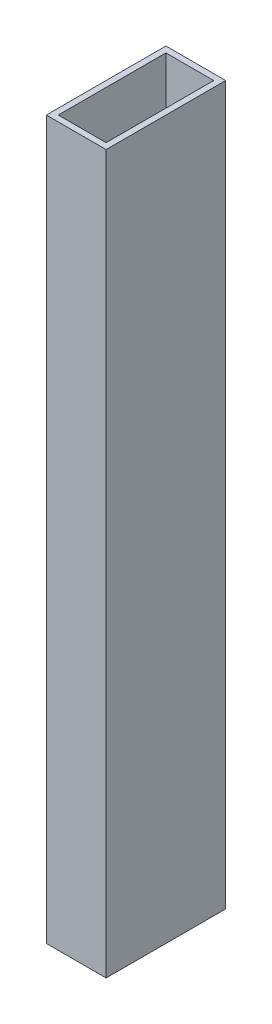
ISO-10303-21;
HEADER;
FILE_DESCRIPTION(('STEP AP214'),'2;1');
FILE_NAME('part.step','',(''),(''),'','','');
FILE_SCHEMA(('AUTOMOTIVE_DESIGN { 1 0 10303 214 1 1 1 1 }'));
ENDSEC;
DATA;
#1=APPLICATION_CONTEXT('core data for automotive mechanical design processes');
#2=APPLICATION_PROTOCOL_DEFINITION('international standard','automotive_design',2000,#1);
#3=PRODUCT_CONTEXT('',#1,'mechanical');
#4=PRODUCT('Part','Part','',(#3));
#5=PRODUCT_RELATED_PRODUCT_CATEGORY('part','',(#4));
#6=PRODUCT_DEFINITION_FORMATION('','',#4);
#7=PRODUCT_DEFINITION_CONTEXT('part definition',#1,'design');
#8=PRODUCT_DEFINITION('design','',#6,#7);
#9=PRODUCT_DEFINITION_SHAPE('','',#8);
#10=(LENGTH_UNIT() NAMED_UNIT(*) SI_UNIT(.MILLI.,.METRE.));
#11=(NAMED_UNIT(*) PLANE_ANGLE_UNIT() SI_UNIT($,.RADIAN.));
#12=(NAMED_UNIT(*) SI_UNIT($,.STERADIAN.) SOLID_ANGLE_UNIT());
#13=UNCERTAINTY_MEASURE_WITH_UNIT(LENGTH_MEASURE(1.E-05),#10,'distance_accuracy_value','');
#14=(GEOMETRIC_REPRESENTATION_CONTEXT(3) GLOBAL_UNCERTAINTY_ASSIGNED_CONTEXT((#13)) GLOBAL_UNIT_ASSIGNED_CONTEXT((#10,
#11,#12)) REPRESENTATION_CONTEXT('',''));
#15=CARTESIAN_POINT('',(0.,0.,0.));
#16=DIRECTION('',(0.,0.,1.));
#17=DIRECTION('',(1.,0.,0.));
#18=AXIS2_PLACEMENT_3D('',#15,#16,#17);
#19=CARTESIAN_POINT('',(0.,120.,0.));
#20=DIRECTION('',(0.,1.,0.));
#21=DIRECTION('',(0.,0.,1.));
#22=AXIS2_PLACEMENT_3D('',#19,#20,#21);
#23=PLANE('',#22);
#24=DIRECTION('',(0.,0.,1.));
#25=VECTOR('',#24,1.);
#26=CARTESIAN_POINT('',(-5.,120.,10.));
#27=LINE('',#26,#25);
#28=CARTESIAN_POINT('',(-5.,120.,-9.99999999999999));
#29=VERTEX_POINT('',#28);
#30=CARTESIAN_POINT('',(-5.,120.,10.));
#31=VERTEX_POINT('',#30);
#32=EDGE_CURVE('E136',#29,#31,#27,.T.);
#33=ORIENTED_EDGE('',*,*,#32,.T.);
#34=DIRECTION('',(1.,0.,0.));
#35=VECTOR('',#34,1.);
#36=CARTESIAN_POINT('',(5.,120.,10.));
#37=LINE('',#36,#35);
#38=CARTESIAN_POINT('',(5.,120.,10.));
#39=VERTEX_POINT('',#38);
#40=EDGE_CURVE('E139',#31,#39,#37,.T.);
#41=ORIENTED_EDGE('',*,*,#40,.T.);
#42=DIRECTION('',(0.,0.,-1.));
#43=VECTOR('',#42,1.);
#44=CARTESIAN_POINT('',(5.,120.,10.));
#45=LINE('',#44,#43);
#46=CARTESIAN_POINT('',(5.,120.,-10.));
#47=VERTEX_POINT('',#46);
#48=EDGE_CURVE('E142',#39,#47,#45,.T.);
#49=ORIENTED_EDGE('',*,*,#48,.T.);
#50=DIRECTION('',(-1.,0.,0.));
#51=VECTOR('',#50,1.);
#52=CARTESIAN_POINT('',(5.,120.,-10.));
#53=LINE('',#52,#51);
#54=EDGE_CURVE('E144',#47,#29,#53,.T.);
#55=ORIENTED_EDGE('',*,*,#54,.T.);
#56=EDGE_LOOP('',(#33,#41,#49,#55));
#57=FACE_BOUND('',#56,.T.);
#58=DIRECTION('',(1.,0.,0.));
#59=VECTOR('',#58,1.);
#60=CARTESIAN_POINT('',(4.,120.,9.));
#61=LINE('',#60,#59);
#62=CARTESIAN_POINT('',(-4.,120.,9.));
#63=VERTEX_POINT('',#62);
#64=CARTESIAN_POINT('',(4.,120.,9.));
#65=VERTEX_POINT('',#64);
#66=EDGE_CURVE('E108',#63,#65,#61,.T.);
#67=ORIENTED_EDGE('',*,*,#66,.F.);
#68=DIRECTION('',(0.,0.,1.));
#69=VECTOR('',#68,1.);
#70=CARTESIAN_POINT('',(-4.,120.,9.));
#71=LINE('',#70,#69);
#72=CARTESIAN_POINT('',(-4.,120.,-9.));
#73=VERTEX_POINT('',#72);
#74=EDGE_CURVE('E100',#73,#63,#71,.T.);
#75=ORIENTED_EDGE('',*,*,#74,.F.);
#76=DIRECTION('',(-1.,0.,0.));
#77=VECTOR('',#76,1.);
#78=CARTESIAN_POINT('',(4.,120.,-9.));
#79=LINE('',#78,#77);
#80=CARTESIAN_POINT('',(4.,120.,-9.));
#81=VERTEX_POINT('',#80);
#82=EDGE_CURVE('E122',#81,#73,#79,.T.);
#83=ORIENTED_EDGE('',*,*,#82,.F.);
#84=DIRECTION('',(0.,0.,-1.));
#85=VECTOR('',#84,1.);
#86=CARTESIAN_POINT('',(4.,120.,9.));
#87=LINE('',#86,#85);
#88=EDGE_CURVE('E120',#65,#81,#87,.T.);
#89=ORIENTED_EDGE('',*,*,#88,.F.);
#90=EDGE_LOOP('',(#67,#75,#83,#89));
#91=FACE_BOUND('',#90,.T.);
#92=ADVANCED_FACE('F35',(#57,#91),#23,.T.);
#93=CARTESIAN_POINT('',(0.,0.,0.));
#94=DIRECTION('',(0.,1.,0.));
#95=DIRECTION('',(0.,0.,1.));
#96=AXIS2_PLACEMENT_3D('',#93,#94,#95);
#97=PLANE('',#96);
#98=DIRECTION('',(0.,0.,1.));
#99=VECTOR('',#98,1.);
#100=CARTESIAN_POINT('',(-5.,0.,10.));
#101=LINE('',#100,#99);
#102=CARTESIAN_POINT('',(-5.,0.,-9.99999999999999));
#103=VERTEX_POINT('',#102);
#104=CARTESIAN_POINT('',(-5.,0.,10.));
#105=VERTEX_POINT('',#104);
#106=EDGE_CURVE('E116',#103,#105,#101,.T.);
#107=ORIENTED_EDGE('',*,*,#106,.F.);
#108=DIRECTION('',(-1.,0.,0.));
#109=VECTOR('',#108,1.);
#110=CARTESIAN_POINT('',(5.,0.,-10.));
#111=LINE('',#110,#109);
#112=CARTESIAN_POINT('',(5.,0.,-10.));
#113=VERTEX_POINT('',#112);
#114=EDGE_CURVE('E140',#113,#103,#111,.T.);
#115=ORIENTED_EDGE('',*,*,#114,.F.);
#116=DIRECTION('',(0.,0.,-1.));
#117=VECTOR('',#116,1.);
#118=CARTESIAN_POINT('',(5.,0.,10.));
#119=LINE('',#118,#117);
#120=CARTESIAN_POINT('',(5.,0.,10.));
#121=VERTEX_POINT('',#120);
#122=EDGE_CURVE('E151',#121,#113,#119,.T.);
#123=ORIENTED_EDGE('',*,*,#122,.F.);
#124=DIRECTION('',(1.,0.,0.));
#125=VECTOR('',#124,1.);
#126=CARTESIAN_POINT('',(5.,0.,10.));
#127=LINE('',#126,#125);
#128=EDGE_CURVE('E149',#105,#121,#127,.T.);
#129=ORIENTED_EDGE('',*,*,#128,.F.);
#130=EDGE_LOOP('',(#107,#115,#123,#129));
#131=FACE_BOUND('',#130,.T.);
#132=DIRECTION('',(0.,0.,1.));
#133=VECTOR('',#132,1.);
#134=CARTESIAN_POINT('',(-4.,0.,9.));
#135=LINE('',#134,#133);
#136=CARTESIAN_POINT('',(-4.,0.,-9.));
#137=VERTEX_POINT('',#136);
#138=CARTESIAN_POINT('',(-4.,0.,9.));
#139=VERTEX_POINT('',#138);
#140=EDGE_CURVE('E58',#137,#139,#135,.T.);
#141=ORIENTED_EDGE('',*,*,#140,.T.);
#142=DIRECTION('',(1.,0.,0.));
#143=VECTOR('',#142,1.);
#144=CARTESIAN_POINT('',(4.,0.,9.));
#145=LINE('',#144,#143);
#146=CARTESIAN_POINT('',(4.,0.,9.));
#147=VERTEX_POINT('',#146);
#148=EDGE_CURVE('E115',#139,#147,#145,.T.);
#149=ORIENTED_EDGE('',*,*,#148,.T.);
#150=DIRECTION('',(0.,0.,-1.));
#151=VECTOR('',#150,1.);
#152=CARTESIAN_POINT('',(4.,0.,9.));
#153=LINE('',#152,#151);
#154=CARTESIAN_POINT('',(4.,0.,-9.));
#155=VERTEX_POINT('',#154);
#156=EDGE_CURVE('E128',#147,#155,#153,.T.);
#157=ORIENTED_EDGE('',*,*,#156,.T.);
#158=DIRECTION('',(-1.,0.,0.));
#159=VECTOR('',#158,1.);
#160=CARTESIAN_POINT('',(4.,0.,-9.));
#161=LINE('',#160,#159);
#162=EDGE_CURVE('E109',#155,#137,#161,.T.);
#163=ORIENTED_EDGE('',*,*,#162,.T.);
#164=EDGE_LOOP('',(#141,#149,#157,#163));
#165=FACE_BOUND('',#164,.T.);
#166=ADVANCED_FACE('F169',(#131,#165),#97,.F.);
#167=CARTESIAN_POINT('',(-5.,120.,10.));
#168=DIRECTION('',(1.,0.,0.));
#169=DIRECTION('',(0.,0.,-1.));
#170=AXIS2_PLACEMENT_3D('',#167,#168,#169);
#171=PLANE('',#170);
#172=ORIENTED_EDGE('',*,*,#106,.T.);
#173=DIRECTION('',(0.,-1.,0.));
#174=VECTOR('',#173,1.);
#175=CARTESIAN_POINT('',(-5.,120.,10.));
#176=LINE('',#175,#174);
#177=EDGE_CURVE('E11',#31,#105,#176,.T.);
#178=ORIENTED_EDGE('',*,*,#177,.F.);
#179=ORIENTED_EDGE('',*,*,#32,.F.);
#180=DIRECTION('',(0.,-1.,0.));
#181=VECTOR('',#180,1.);
#182=CARTESIAN_POINT('',(-5.,120.,-9.99999999999999));
#183=LINE('',#182,#181);
#184=EDGE_CURVE('E146',#29,#103,#183,.T.);
#185=ORIENTED_EDGE('',*,*,#184,.T.);
#186=EDGE_LOOP('',(#172,#178,#179,#185));
#187=FACE_BOUND('',#186,.T.);
#188=ADVANCED_FACE('F37',(#187),#171,.F.);
#189=CARTESIAN_POINT('',(5.,120.,10.));
#190=DIRECTION('',(0.,0.,-1.));
#191=DIRECTION('',(-1.,0.,0.));
#192=AXIS2_PLACEMENT_3D('',#189,#190,#191);
#193=PLANE('',#192);
#194=ORIENTED_EDGE('',*,*,#128,.T.);
#195=DIRECTION('',(0.,-1.,0.));
#196=VECTOR('',#195,1.);
#197=CARTESIAN_POINT('',(5.,120.,10.));
#198=LINE('',#197,#196);
#199=EDGE_CURVE('E43',#39,#121,#198,.T.);
#200=ORIENTED_EDGE('',*,*,#199,.F.);
#201=ORIENTED_EDGE('',*,*,#40,.F.);
#202=ORIENTED_EDGE('',*,*,#177,.T.);
#203=EDGE_LOOP('',(#194,#200,#201,#202));
#204=FACE_BOUND('',#203,.T.);
#205=ADVANCED_FACE('F179',(#204),#193,.F.);
#206=CARTESIAN_POINT('',(5.,120.,10.));
#207=DIRECTION('',(-1.,0.,0.));
#208=DIRECTION('',(0.,0.,1.));
#209=AXIS2_PLACEMENT_3D('',#206,#207,#208);
#210=PLANE('',#209);
#211=ORIENTED_EDGE('',*,*,#122,.T.);
#212=DIRECTION('',(0.,-1.,0.));
#213=VECTOR('',#212,1.);
#214=CARTESIAN_POINT('',(5.,120.,-10.));
#215=LINE('',#214,#213);
#216=EDGE_CURVE('E156',#47,#113,#215,.T.);
#217=ORIENTED_EDGE('',*,*,#216,.F.);
#218=ORIENTED_EDGE('',*,*,#48,.F.);
#219=ORIENTED_EDGE('',*,*,#199,.T.);
#220=EDGE_LOOP('',(#211,#217,#218,#219));
#221=FACE_BOUND('',#220,.T.);
#222=ADVANCED_FACE('F163',(#221),#210,.F.);
#223=CARTESIAN_POINT('',(5.,120.,-10.));
#224=DIRECTION('',(0.,0.,1.));
#225=DIRECTION('',(1.,0.,0.));
#226=AXIS2_PLACEMENT_3D('',#223,#224,#225);
#227=PLANE('',#226);
#228=ORIENTED_EDGE('',*,*,#114,.T.);
#229=ORIENTED_EDGE('',*,*,#184,.F.);
#230=ORIENTED_EDGE('',*,*,#54,.F.);
#231=ORIENTED_EDGE('',*,*,#216,.T.);
#232=EDGE_LOOP('',(#228,#229,#230,#231));
#233=FACE_BOUND('',#232,.T.);
#234=ADVANCED_FACE('F173',(#233),#227,.F.);
#235=CARTESIAN_POINT('',(-4.,120.,9.));
#236=DIRECTION('',(1.,0.,0.));
#237=DIRECTION('',(0.,0.,-1.));
#238=AXIS2_PLACEMENT_3D('',#235,#236,#237);
#239=PLANE('',#238);
#240=ORIENTED_EDGE('',*,*,#140,.F.);
#241=DIRECTION('',(0.,-1.,0.));
#242=VECTOR('',#241,1.);
#243=CARTESIAN_POINT('',(-4.,120.,-9.));
#244=LINE('',#243,#242);
#245=EDGE_CURVE('E104',#73,#137,#244,.T.);
#246=ORIENTED_EDGE('',*,*,#245,.F.);
#247=ORIENTED_EDGE('',*,*,#74,.T.);
#248=DIRECTION('',(0.,-1.,0.));
#249=VECTOR('',#248,1.);
#250=CARTESIAN_POINT('',(-4.,120.,9.));
#251=LINE('',#250,#249);
#252=EDGE_CURVE('E103',#63,#139,#251,.T.);
#253=ORIENTED_EDGE('',*,*,#252,.T.);
#254=EDGE_LOOP('',(#240,#246,#247,#253));
#255=FACE_BOUND('',#254,.T.);
#256=ADVANCED_FACE('F102',(#255),#239,.T.);
#257=CARTESIAN_POINT('',(4.,120.,9.));
#258=DIRECTION('',(0.,0.,-1.));
#259=DIRECTION('',(-1.,0.,0.));
#260=AXIS2_PLACEMENT_3D('',#257,#258,#259);
#261=PLANE('',#260);
#262=ORIENTED_EDGE('',*,*,#148,.F.);
#263=ORIENTED_EDGE('',*,*,#252,.F.);
#264=ORIENTED_EDGE('',*,*,#66,.T.);
#265=DIRECTION('',(0.,-1.,0.));
#266=VECTOR('',#265,1.);
#267=CARTESIAN_POINT('',(4.,120.,9.));
#268=LINE('',#267,#266);
#269=EDGE_CURVE('E117',#65,#147,#268,.T.);
#270=ORIENTED_EDGE('',*,*,#269,.T.);
#271=EDGE_LOOP('',(#262,#263,#264,#270));
#272=FACE_BOUND('',#271,.T.);
#273=ADVANCED_FACE('F112',(#272),#261,.T.);
#274=CARTESIAN_POINT('',(4.,120.,9.));
#275=DIRECTION('',(-1.,0.,0.));
#276=DIRECTION('',(0.,0.,1.));
#277=AXIS2_PLACEMENT_3D('',#274,#275,#276);
#278=PLANE('',#277);
#279=ORIENTED_EDGE('',*,*,#156,.F.);
#280=ORIENTED_EDGE('',*,*,#269,.F.);
#281=ORIENTED_EDGE('',*,*,#88,.T.);
#282=DIRECTION('',(0.,-1.,0.));
#283=VECTOR('',#282,1.);
#284=CARTESIAN_POINT('',(4.,120.,-9.));
#285=LINE('',#284,#283);
#286=EDGE_CURVE('E50',#81,#155,#285,.T.);
#287=ORIENTED_EDGE('',*,*,#286,.T.);
#288=EDGE_LOOP('',(#279,#280,#281,#287));
#289=FACE_BOUND('',#288,.T.);
#290=ADVANCED_FACE('F202',(#289),#278,.T.);
#291=CARTESIAN_POINT('',(4.,120.,-9.));
#292=DIRECTION('',(0.,0.,1.));
#293=DIRECTION('',(1.,0.,0.));
#294=AXIS2_PLACEMENT_3D('',#291,#292,#293);
#295=PLANE('',#294);
#296=ORIENTED_EDGE('',*,*,#162,.F.);
#297=ORIENTED_EDGE('',*,*,#286,.F.);
#298=ORIENTED_EDGE('',*,*,#82,.T.);
#299=ORIENTED_EDGE('',*,*,#245,.T.);
#300=EDGE_LOOP('',(#296,#297,#298,#299));
#301=FACE_BOUND('',#300,.T.);
#302=ADVANCED_FACE('F206',(#301),#295,.T.);
#303=CLOSED_SHELL('',(#92,#166,#188,#205,#222,#234,#256,#273,#290,#302));
#304=MANIFOLD_SOLID_BREP('B2',#303);
#305=ADVANCED_BREP_SHAPE_REPRESENTATION('',(#18,#304),#14);
#306=SHAPE_DEFINITION_REPRESENTATION(#9,#305);
ENDSEC;
END-ISO-10303-21;
